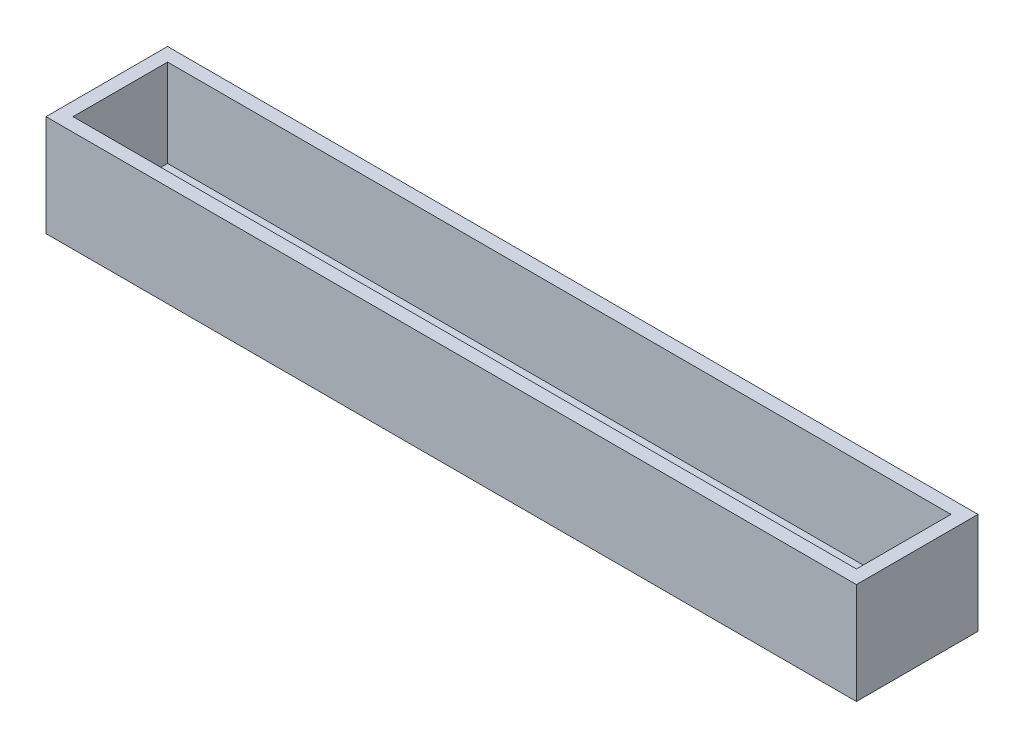
ISO-10303-21;
HEADER;
FILE_DESCRIPTION(('STEP AP214'),'2;1');
FILE_NAME('part.step','',(''),(''),'','','');
FILE_SCHEMA(('AUTOMOTIVE_DESIGN { 1 0 10303 214 1 1 1 1 }'));
ENDSEC;
DATA;
#1=APPLICATION_CONTEXT('core data for automotive mechanical design processes');
#2=APPLICATION_PROTOCOL_DEFINITION('international standard','automotive_design',2000,#1);
#3=PRODUCT_CONTEXT('',#1,'mechanical');
#4=PRODUCT('Part','Part','',(#3));
#5=PRODUCT_RELATED_PRODUCT_CATEGORY('part','',(#4));
#6=PRODUCT_DEFINITION_FORMATION('','',#4);
#7=PRODUCT_DEFINITION_CONTEXT('part definition',#1,'design');
#8=PRODUCT_DEFINITION('design','',#6,#7);
#9=PRODUCT_DEFINITION_SHAPE('','',#8);
#10=(LENGTH_UNIT() NAMED_UNIT(*) SI_UNIT(.MILLI.,.METRE.));
#11=(NAMED_UNIT(*) PLANE_ANGLE_UNIT() SI_UNIT($,.RADIAN.));
#12=(NAMED_UNIT(*) SI_UNIT($,.STERADIAN.) SOLID_ANGLE_UNIT());
#13=UNCERTAINTY_MEASURE_WITH_UNIT(LENGTH_MEASURE(1.E-05),#10,'distance_accuracy_value','');
#14=(GEOMETRIC_REPRESENTATION_CONTEXT(3) GLOBAL_UNCERTAINTY_ASSIGNED_CONTEXT((#13)) GLOBAL_UNIT_ASSIGNED_CONTEXT((#10,
#11,#12)) REPRESENTATION_CONTEXT('',''));
#15=CARTESIAN_POINT('',(0.,0.,0.));
#16=DIRECTION('',(0.,0.,1.));
#17=DIRECTION('',(1.,0.,0.));
#18=AXIS2_PLACEMENT_3D('',#15,#16,#17);
#19=CARTESIAN_POINT('',(0.,1.,0.));
#20=DIRECTION('',(1.,0.,0.));
#21=DIRECTION('',(0.,0.,-1.));
#22=AXIS2_PLACEMENT_3D('',#19,#20,#21);
#23=PLANE('',#22);
#24=DIRECTION('',(0.,0.,1.));
#25=VECTOR('',#24,1.);
#26=CARTESIAN_POINT('',(0.,0.,0.));
#27=LINE('',#26,#25);
#28=CARTESIAN_POINT('',(0.,0.,-9.));
#29=VERTEX_POINT('',#28);
#30=CARTESIAN_POINT('',(0.,0.,0.));
#31=VERTEX_POINT('',#30);
#32=EDGE_CURVE('E197',#29,#31,#27,.T.);
#33=ORIENTED_EDGE('',*,*,#32,.T.);
#34=DIRECTION('',(0.,-1.,0.));
#35=VECTOR('',#34,1.);
#36=CARTESIAN_POINT('',(0.,1.,0.));
#37=LINE('',#36,#35);
#38=CARTESIAN_POINT('',(0.,7.5,0.));
#39=VERTEX_POINT('',#38);
#40=EDGE_CURVE('E215',#39,#31,#37,.T.);
#41=ORIENTED_EDGE('',*,*,#40,.F.);
#42=DIRECTION('',(0.,0.,1.));
#43=VECTOR('',#42,1.);
#44=CARTESIAN_POINT('',(0.,7.5,0.));
#45=LINE('',#44,#43);
#46=CARTESIAN_POINT('',(0.,7.5,-9.));
#47=VERTEX_POINT('',#46);
#48=EDGE_CURVE('E185',#47,#39,#45,.T.);
#49=ORIENTED_EDGE('',*,*,#48,.F.);
#50=DIRECTION('',(0.,-1.,0.));
#51=VECTOR('',#50,1.);
#52=CARTESIAN_POINT('',(0.,1.,-9.));
#53=LINE('',#52,#51);
#54=EDGE_CURVE('E206',#47,#29,#53,.T.);
#55=ORIENTED_EDGE('',*,*,#54,.T.);
#56=EDGE_LOOP('',(#33,#41,#49,#55));
#57=FACE_BOUND('',#56,.T.);
#58=ADVANCED_FACE('F39',(#57),#23,.F.);
#59=CARTESIAN_POINT('',(0.,1.,0.));
#60=DIRECTION('',(0.,0.,-1.));
#61=DIRECTION('',(-1.,0.,0.));
#62=AXIS2_PLACEMENT_3D('',#59,#60,#61);
#63=PLANE('',#62);
#64=DIRECTION('',(1.,0.,0.));
#65=VECTOR('',#64,1.);
#66=CARTESIAN_POINT('',(0.,0.,0.));
#67=LINE('',#66,#65);
#68=CARTESIAN_POINT('',(60.,0.,0.));
#69=VERTEX_POINT('',#68);
#70=EDGE_CURVE('E200',#31,#69,#67,.T.);
#71=ORIENTED_EDGE('',*,*,#70,.T.);
#72=DIRECTION('',(0.,-1.,0.));
#73=VECTOR('',#72,1.);
#74=CARTESIAN_POINT('',(60.,1.,0.));
#75=LINE('',#74,#73);
#76=CARTESIAN_POINT('',(60.,7.5,0.));
#77=VERTEX_POINT('',#76);
#78=EDGE_CURVE('E212',#77,#69,#75,.T.);
#79=ORIENTED_EDGE('',*,*,#78,.F.);
#80=DIRECTION('',(1.,0.,0.));
#81=VECTOR('',#80,1.);
#82=CARTESIAN_POINT('',(0.,7.5,0.));
#83=LINE('',#82,#81);
#84=EDGE_CURVE('E188',#39,#77,#83,.T.);
#85=ORIENTED_EDGE('',*,*,#84,.F.);
#86=ORIENTED_EDGE('',*,*,#40,.T.);
#87=EDGE_LOOP('',(#71,#79,#85,#86));
#88=FACE_BOUND('',#87,.T.);
#89=ADVANCED_FACE('F240',(#88),#63,.F.);
#90=CARTESIAN_POINT('',(60.,1.,0.));
#91=DIRECTION('',(-1.,0.,0.));
#92=DIRECTION('',(0.,0.,1.));
#93=AXIS2_PLACEMENT_3D('',#90,#91,#92);
#94=PLANE('',#93);
#95=DIRECTION('',(0.,0.,-1.));
#96=VECTOR('',#95,1.);
#97=CARTESIAN_POINT('',(60.,0.,0.));
#98=LINE('',#97,#96);
#99=CARTESIAN_POINT('',(60.,0.,-9.));
#100=VERTEX_POINT('',#99);
#101=EDGE_CURVE('E202',#69,#100,#98,.T.);
#102=ORIENTED_EDGE('',*,*,#101,.T.);
#103=DIRECTION('',(0.,-1.,0.));
#104=VECTOR('',#103,1.);
#105=CARTESIAN_POINT('',(60.,1.,-9.));
#106=LINE('',#105,#104);
#107=CARTESIAN_POINT('',(60.,7.5,-9.));
#108=VERTEX_POINT('',#107);
#109=EDGE_CURVE('E209',#108,#100,#106,.T.);
#110=ORIENTED_EDGE('',*,*,#109,.F.);
#111=DIRECTION('',(0.,0.,-1.));
#112=VECTOR('',#111,1.);
#113=CARTESIAN_POINT('',(60.,7.5,0.));
#114=LINE('',#113,#112);
#115=EDGE_CURVE('E191',#77,#108,#114,.T.);
#116=ORIENTED_EDGE('',*,*,#115,.F.);
#117=ORIENTED_EDGE('',*,*,#78,.T.);
#118=EDGE_LOOP('',(#102,#110,#116,#117));
#119=FACE_BOUND('',#118,.T.);
#120=ADVANCED_FACE('F245',(#119),#94,.F.);
#121=CARTESIAN_POINT('',(0.,1.,-9.));
#122=DIRECTION('',(0.,0.,1.));
#123=DIRECTION('',(1.,0.,0.));
#124=AXIS2_PLACEMENT_3D('',#121,#122,#123);
#125=PLANE('',#124);
#126=DIRECTION('',(-1.,0.,0.));
#127=VECTOR('',#126,1.);
#128=CARTESIAN_POINT('',(0.,0.,-9.));
#129=LINE('',#128,#127);
#130=EDGE_CURVE('E204',#100,#29,#129,.T.);
#131=ORIENTED_EDGE('',*,*,#130,.T.);
#132=ORIENTED_EDGE('',*,*,#54,.F.);
#133=DIRECTION('',(-1.,0.,0.));
#134=VECTOR('',#133,1.);
#135=CARTESIAN_POINT('',(0.,7.5,-9.));
#136=LINE('',#135,#134);
#137=EDGE_CURVE('E194',#108,#47,#136,.T.);
#138=ORIENTED_EDGE('',*,*,#137,.F.);
#139=ORIENTED_EDGE('',*,*,#109,.T.);
#140=EDGE_LOOP('',(#131,#132,#138,#139));
#141=FACE_BOUND('',#140,.T.);
#142=ADVANCED_FACE('F258',(#141),#125,.F.);
#143=CARTESIAN_POINT('',(0.,0.,0.));
#144=DIRECTION('',(0.,-1.,0.));
#145=DIRECTION('',(0.,0.,-1.));
#146=AXIS2_PLACEMENT_3D('',#143,#144,#145);
#147=PLANE('',#146);
#148=DIRECTION('',(0.,0.,1.));
#149=VECTOR('',#148,1.);
#150=CARTESIAN_POINT('',(56.,0.,-5.99999999999999));
#151=LINE('',#150,#149);
#152=CARTESIAN_POINT('',(56.,0.,-5.99999999999999));
#153=VERTEX_POINT('',#152);
#154=CARTESIAN_POINT('',(56.,0.,-3.));
#155=VERTEX_POINT('',#154);
#156=EDGE_CURVE('E53',#153,#155,#151,.T.);
#157=ORIENTED_EDGE('',*,*,#156,.F.);
#158=DIRECTION('',(1.,0.,0.));
#159=VECTOR('',#158,1.);
#160=CARTESIAN_POINT('',(56.,0.,-5.99999999999999));
#161=LINE('',#160,#159);
#162=CARTESIAN_POINT('',(4.,0.,-6.00000000000001));
#163=VERTEX_POINT('',#162);
#164=EDGE_CURVE('E146',#163,#153,#161,.T.);
#165=ORIENTED_EDGE('',*,*,#164,.F.);
#166=DIRECTION('',(0.,0.,-1.));
#167=VECTOR('',#166,1.);
#168=CARTESIAN_POINT('',(4.,0.,-6.00000000000001));
#169=LINE('',#168,#167);
#170=CARTESIAN_POINT('',(4.,0.,-2.99999999999999));
#171=VERTEX_POINT('',#170);
#172=EDGE_CURVE('E130',#171,#163,#169,.T.);
#173=ORIENTED_EDGE('',*,*,#172,.F.);
#174=DIRECTION('',(-1.,0.,0.));
#175=VECTOR('',#174,1.);
#176=CARTESIAN_POINT('',(56.,0.,-3.));
#177=LINE('',#176,#175);
#178=EDGE_CURVE('E139',#155,#171,#177,.T.);
#179=ORIENTED_EDGE('',*,*,#178,.F.);
#180=EDGE_LOOP('',(#157,#165,#173,#179));
#181=FACE_BOUND('',#180,.T.);
#182=ORIENTED_EDGE('',*,*,#32,.F.);
#183=ORIENTED_EDGE('',*,*,#130,.F.);
#184=ORIENTED_EDGE('',*,*,#101,.F.);
#185=ORIENTED_EDGE('',*,*,#70,.F.);
#186=EDGE_LOOP('',(#182,#183,#184,#185));
#187=FACE_BOUND('',#186,.T.);
#188=ADVANCED_FACE('F143',(#181,#187),#147,.T.);
#189=CARTESIAN_POINT('',(0.,7.5,0.));
#190=DIRECTION('',(0.,-1.,0.));
#191=DIRECTION('',(0.,0.,-1.));
#192=AXIS2_PLACEMENT_3D('',#189,#190,#191);
#193=PLANE('',#192);
#194=ORIENTED_EDGE('',*,*,#48,.T.);
#195=ORIENTED_EDGE('',*,*,#84,.T.);
#196=ORIENTED_EDGE('',*,*,#115,.T.);
#197=ORIENTED_EDGE('',*,*,#137,.T.);
#198=EDGE_LOOP('',(#194,#195,#196,#197));
#199=FACE_BOUND('',#198,.T.);
#200=DIRECTION('',(0.,0.,1.));
#201=VECTOR('',#200,1.);
#202=CARTESIAN_POINT('',(1.,7.5,-8.));
#203=LINE('',#202,#201);
#204=CARTESIAN_POINT('',(1.,7.5,-8.));
#205=VERTEX_POINT('',#204);
#206=CARTESIAN_POINT('',(1.,7.5,-1.));
#207=VERTEX_POINT('',#206);
#208=EDGE_CURVE('E156',#205,#207,#203,.T.);
#209=ORIENTED_EDGE('',*,*,#208,.F.);
#210=DIRECTION('',(-1.,0.,0.));
#211=VECTOR('',#210,1.);
#212=CARTESIAN_POINT('',(1.,7.5,-8.));
#213=LINE('',#212,#211);
#214=CARTESIAN_POINT('',(59.,7.5,-8.));
#215=VERTEX_POINT('',#214);
#216=EDGE_CURVE('E164',#215,#205,#213,.T.);
#217=ORIENTED_EDGE('',*,*,#216,.F.);
#218=DIRECTION('',(0.,0.,-1.));
#219=VECTOR('',#218,1.);
#220=CARTESIAN_POINT('',(59.,7.5,-8.));
#221=LINE('',#220,#219);
#222=CARTESIAN_POINT('',(59.,7.5,-1.));
#223=VERTEX_POINT('',#222);
#224=EDGE_CURVE('E161',#223,#215,#221,.T.);
#225=ORIENTED_EDGE('',*,*,#224,.F.);
#226=DIRECTION('',(1.,0.,0.));
#227=VECTOR('',#226,1.);
#228=CARTESIAN_POINT('',(1.,7.5,-1.));
#229=LINE('',#228,#227);
#230=EDGE_CURVE('E158',#207,#223,#229,.T.);
#231=ORIENTED_EDGE('',*,*,#230,.F.);
#232=EDGE_LOOP('',(#209,#217,#225,#231));
#233=FACE_BOUND('',#232,.T.);
#234=ADVANCED_FACE('F254',(#199,#233),#193,.F.);
#235=CARTESIAN_POINT('',(1.,7.5,-8.));
#236=DIRECTION('',(1.,0.,0.));
#237=DIRECTION('',(0.,0.,-1.));
#238=AXIS2_PLACEMENT_3D('',#235,#236,#237);
#239=PLANE('',#238);
#240=DIRECTION('',(0.,0.,1.));
#241=VECTOR('',#240,1.);
#242=CARTESIAN_POINT('',(1.,1.,-8.));
#243=LINE('',#242,#241);
#244=CARTESIAN_POINT('',(1.,1.,-8.));
#245=VERTEX_POINT('',#244);
#246=CARTESIAN_POINT('',(1.,1.,-1.));
#247=VERTEX_POINT('',#246);
#248=EDGE_CURVE('E153',#245,#247,#243,.T.);
#249=ORIENTED_EDGE('',*,*,#248,.F.);
#250=DIRECTION('',(0.,-1.,0.));
#251=VECTOR('',#250,1.);
#252=CARTESIAN_POINT('',(1.,7.5,-8.));
#253=LINE('',#252,#251);
#254=EDGE_CURVE('E166',#205,#245,#253,.T.);
#255=ORIENTED_EDGE('',*,*,#254,.F.);
#256=ORIENTED_EDGE('',*,*,#208,.T.);
#257=DIRECTION('',(0.,-1.,0.));
#258=VECTOR('',#257,1.);
#259=CARTESIAN_POINT('',(1.,7.5,-1.));
#260=LINE('',#259,#258);
#261=EDGE_CURVE('E182',#207,#247,#260,.T.);
#262=ORIENTED_EDGE('',*,*,#261,.T.);
#263=EDGE_LOOP('',(#249,#255,#256,#262));
#264=FACE_BOUND('',#263,.T.);
#265=ADVANCED_FACE('F271',(#264),#239,.T.);
#266=CARTESIAN_POINT('',(1.,7.5,-1.));
#267=DIRECTION('',(0.,0.,-1.));
#268=DIRECTION('',(-1.,0.,0.));
#269=AXIS2_PLACEMENT_3D('',#266,#267,#268);
#270=PLANE('',#269);
#271=DIRECTION('',(1.,0.,0.));
#272=VECTOR('',#271,1.);
#273=CARTESIAN_POINT('',(1.,1.,-1.));
#274=LINE('',#273,#272);
#275=CARTESIAN_POINT('',(59.,1.,-1.));
#276=VERTEX_POINT('',#275);
#277=EDGE_CURVE('E169',#247,#276,#274,.T.);
#278=ORIENTED_EDGE('',*,*,#277,.F.);
#279=ORIENTED_EDGE('',*,*,#261,.F.);
#280=ORIENTED_EDGE('',*,*,#230,.T.);
#281=DIRECTION('',(0.,-1.,0.));
#282=VECTOR('',#281,1.);
#283=CARTESIAN_POINT('',(59.,7.5,-1.));
#284=LINE('',#283,#282);
#285=EDGE_CURVE('E180',#223,#276,#284,.T.);
#286=ORIENTED_EDGE('',*,*,#285,.T.);
#287=EDGE_LOOP('',(#278,#279,#280,#286));
#288=FACE_BOUND('',#287,.T.);
#289=ADVANCED_FACE('F274',(#288),#270,.T.);
#290=CARTESIAN_POINT('',(59.,7.5,-8.));
#291=DIRECTION('',(-1.,0.,0.));
#292=DIRECTION('',(0.,0.,1.));
#293=AXIS2_PLACEMENT_3D('',#290,#291,#292);
#294=PLANE('',#293);
#295=DIRECTION('',(0.,0.,-1.));
#296=VECTOR('',#295,1.);
#297=CARTESIAN_POINT('',(59.,1.,-8.));
#298=LINE('',#297,#296);
#299=CARTESIAN_POINT('',(59.,1.,-8.));
#300=VERTEX_POINT('',#299);
#301=EDGE_CURVE('E172',#276,#300,#298,.T.);
#302=ORIENTED_EDGE('',*,*,#301,.F.);
#303=ORIENTED_EDGE('',*,*,#285,.F.);
#304=ORIENTED_EDGE('',*,*,#224,.T.);
#305=DIRECTION('',(0.,-1.,0.));
#306=VECTOR('',#305,1.);
#307=CARTESIAN_POINT('',(59.,7.5,-8.));
#308=LINE('',#307,#306);
#309=EDGE_CURVE('E178',#215,#300,#308,.T.);
#310=ORIENTED_EDGE('',*,*,#309,.T.);
#311=EDGE_LOOP('',(#302,#303,#304,#310));
#312=FACE_BOUND('',#311,.T.);
#313=ADVANCED_FACE('F278',(#312),#294,.T.);
#314=CARTESIAN_POINT('',(1.,7.5,-8.));
#315=DIRECTION('',(0.,0.,1.));
#316=DIRECTION('',(1.,0.,0.));
#317=AXIS2_PLACEMENT_3D('',#314,#315,#316);
#318=PLANE('',#317);
#319=DIRECTION('',(-1.,0.,0.));
#320=VECTOR('',#319,1.);
#321=CARTESIAN_POINT('',(1.,1.,-8.));
#322=LINE('',#321,#320);
#323=EDGE_CURVE('E159',#300,#245,#322,.T.);
#324=ORIENTED_EDGE('',*,*,#323,.F.);
#325=ORIENTED_EDGE('',*,*,#309,.F.);
#326=ORIENTED_EDGE('',*,*,#216,.T.);
#327=ORIENTED_EDGE('',*,*,#254,.T.);
#328=EDGE_LOOP('',(#324,#325,#326,#327));
#329=FACE_BOUND('',#328,.T.);
#330=ADVANCED_FACE('F235',(#329),#318,.T.);
#331=CARTESIAN_POINT('',(0.,1.,0.));
#332=DIRECTION('',(0.,-1.,0.));
#333=DIRECTION('',(0.,0.,-1.));
#334=AXIS2_PLACEMENT_3D('',#331,#332,#333);
#335=PLANE('',#334);
#336=DIRECTION('',(1.,0.,0.));
#337=VECTOR('',#336,1.);
#338=CARTESIAN_POINT('',(0.,1.,-6.00000000000001));
#339=LINE('',#338,#337);
#340=CARTESIAN_POINT('',(4.,1.,-6.00000000000001));
#341=VERTEX_POINT('',#340);
#342=CARTESIAN_POINT('',(56.,1.,-5.99999999999999));
#343=VERTEX_POINT('',#342);
#344=EDGE_CURVE('E46',#341,#343,#339,.T.);
#345=ORIENTED_EDGE('',*,*,#344,.T.);
#346=DIRECTION('',(0.,0.,1.));
#347=VECTOR('',#346,1.);
#348=CARTESIAN_POINT('',(56.,1.,0.));
#349=LINE('',#348,#347);
#350=CARTESIAN_POINT('',(56.,1.,-3.));
#351=VERTEX_POINT('',#350);
#352=EDGE_CURVE('E11',#343,#351,#349,.T.);
#353=ORIENTED_EDGE('',*,*,#352,.T.);
#354=DIRECTION('',(-1.,0.,0.));
#355=VECTOR('',#354,1.);
#356=CARTESIAN_POINT('',(0.,1.,-2.99999999999999));
#357=LINE('',#356,#355);
#358=CARTESIAN_POINT('',(4.,1.,-2.99999999999999));
#359=VERTEX_POINT('',#358);
#360=EDGE_CURVE('E218',#351,#359,#357,.T.);
#361=ORIENTED_EDGE('',*,*,#360,.T.);
#362=DIRECTION('',(0.,0.,-1.));
#363=VECTOR('',#362,1.);
#364=CARTESIAN_POINT('',(4.,1.,0.));
#365=LINE('',#364,#363);
#366=EDGE_CURVE('E133',#359,#341,#365,.T.);
#367=ORIENTED_EDGE('',*,*,#366,.T.);
#368=EDGE_LOOP('',(#345,#353,#361,#367));
#369=FACE_BOUND('',#368,.T.);
#370=ORIENTED_EDGE('',*,*,#323,.T.);
#371=ORIENTED_EDGE('',*,*,#248,.T.);
#372=ORIENTED_EDGE('',*,*,#277,.T.);
#373=ORIENTED_EDGE('',*,*,#301,.T.);
#374=EDGE_LOOP('',(#370,#371,#372,#373));
#375=FACE_BOUND('',#374,.T.);
#376=ADVANCED_FACE('F222',(#369,#375),#335,.F.);
#377=CARTESIAN_POINT('',(56.,7.5,-5.99999999999999));
#378=DIRECTION('',(1.,0.,0.));
#379=DIRECTION('',(0.,0.,-1.));
#380=AXIS2_PLACEMENT_3D('',#377,#378,#379);
#381=PLANE('',#380);
#382=DIRECTION('',(0.,-1.,0.));
#383=VECTOR('',#382,1.);
#384=CARTESIAN_POINT('',(56.,7.5,-5.99999999999999));
#385=LINE('',#384,#383);
#386=EDGE_CURVE('E151',#343,#153,#385,.T.);
#387=ORIENTED_EDGE('',*,*,#386,.T.);
#388=ORIENTED_EDGE('',*,*,#156,.T.);
#389=DIRECTION('',(0.,-1.,0.));
#390=VECTOR('',#389,1.);
#391=CARTESIAN_POINT('',(56.,7.5,-3.));
#392=LINE('',#391,#390);
#393=EDGE_CURVE('E136',#351,#155,#392,.T.);
#394=ORIENTED_EDGE('',*,*,#393,.F.);
#395=ORIENTED_EDGE('',*,*,#352,.F.);
#396=EDGE_LOOP('',(#387,#388,#394,#395));
#397=FACE_BOUND('',#396,.T.);
#398=ADVANCED_FACE('F227',(#397),#381,.F.);
#399=CARTESIAN_POINT('',(56.,7.5,-5.99999999999999));
#400=DIRECTION('',(0.,0.,-1.));
#401=DIRECTION('',(-1.,0.,0.));
#402=AXIS2_PLACEMENT_3D('',#399,#400,#401);
#403=PLANE('',#402);
#404=DIRECTION('',(0.,-1.,0.));
#405=VECTOR('',#404,1.);
#406=CARTESIAN_POINT('',(4.,7.5,-6.00000000000001));
#407=LINE('',#406,#405);
#408=EDGE_CURVE('E135',#341,#163,#407,.T.);
#409=ORIENTED_EDGE('',*,*,#408,.T.);
#410=ORIENTED_EDGE('',*,*,#164,.T.);
#411=ORIENTED_EDGE('',*,*,#386,.F.);
#412=ORIENTED_EDGE('',*,*,#344,.F.);
#413=EDGE_LOOP('',(#409,#410,#411,#412));
#414=FACE_BOUND('',#413,.T.);
#415=ADVANCED_FACE('F226',(#414),#403,.F.);
#416=CARTESIAN_POINT('',(4.,7.5,-6.00000000000001));
#417=DIRECTION('',(-1.,0.,0.));
#418=DIRECTION('',(0.,0.,1.));
#419=AXIS2_PLACEMENT_3D('',#416,#417,#418);
#420=PLANE('',#419);
#421=DIRECTION('',(0.,-1.,0.));
#422=VECTOR('',#421,1.);
#423=CARTESIAN_POINT('',(4.,7.5,-2.99999999999999));
#424=LINE('',#423,#422);
#425=EDGE_CURVE('E61',#359,#171,#424,.T.);
#426=ORIENTED_EDGE('',*,*,#425,.T.);
#427=ORIENTED_EDGE('',*,*,#172,.T.);
#428=ORIENTED_EDGE('',*,*,#408,.F.);
#429=ORIENTED_EDGE('',*,*,#366,.F.);
#430=EDGE_LOOP('',(#426,#427,#428,#429));
#431=FACE_BOUND('',#430,.T.);
#432=ADVANCED_FACE('F127',(#431),#420,.F.);
#433=CARTESIAN_POINT('',(56.,7.5,-3.));
#434=DIRECTION('',(0.,0.,1.));
#435=DIRECTION('',(1.,0.,0.));
#436=AXIS2_PLACEMENT_3D('',#433,#434,#435);
#437=PLANE('',#436);
#438=ORIENTED_EDGE('',*,*,#393,.T.);
#439=ORIENTED_EDGE('',*,*,#178,.T.);
#440=ORIENTED_EDGE('',*,*,#425,.F.);
#441=ORIENTED_EDGE('',*,*,#360,.F.);
#442=EDGE_LOOP('',(#438,#439,#440,#441));
#443=FACE_BOUND('',#442,.T.);
#444=ADVANCED_FACE('F140',(#443),#437,.F.);
#445=CLOSED_SHELL('',(#58,#89,#120,#142,#188,#234,#265,#289,#313,#330,#376,#398,#415,#432,#444));
#446=MANIFOLD_SOLID_BREP('B2',#445);
#447=ADVANCED_BREP_SHAPE_REPRESENTATION('',(#18,#446),#14);
#448=SHAPE_DEFINITION_REPRESENTATION(#9,#447);
ENDSEC;
END-ISO-10303-21;
